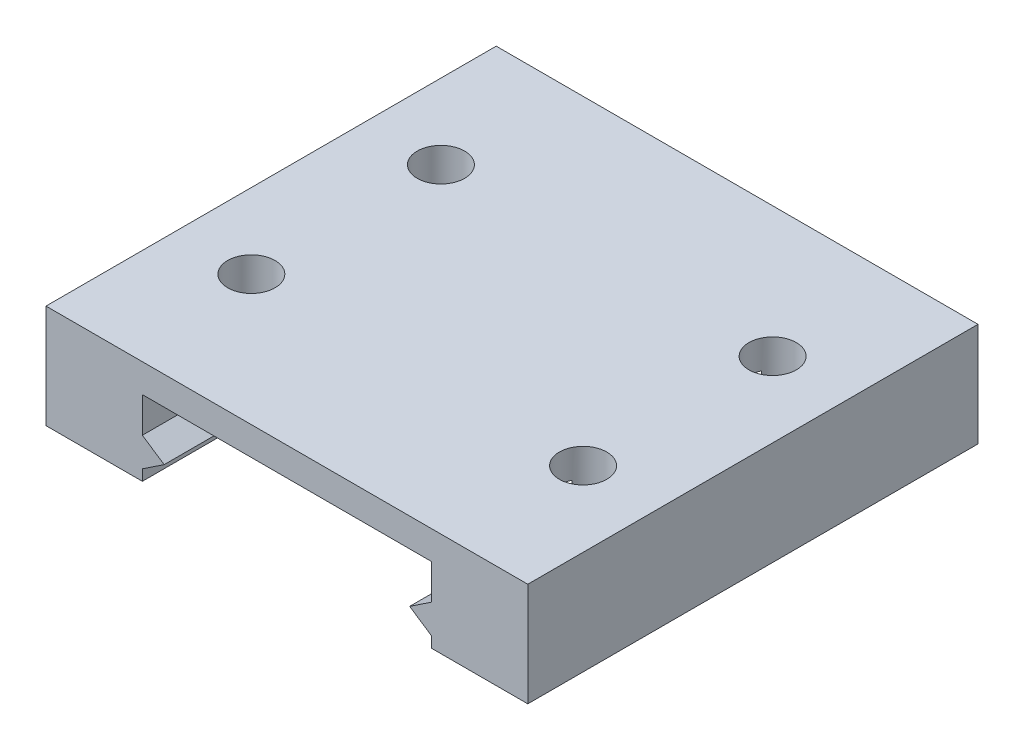
ISO-10303-21;
HEADER;
FILE_DESCRIPTION(('STEP AP214'),'2;1');
FILE_NAME('part.step','',(''),(''),'','','');
FILE_SCHEMA(('AUTOMOTIVE_DESIGN { 1 0 10303 214 1 1 1 1 }'));
ENDSEC;
DATA;
#1=APPLICATION_CONTEXT('core data for automotive mechanical design processes');
#2=APPLICATION_PROTOCOL_DEFINITION('international standard','automotive_design',2000,#1);
#3=PRODUCT_CONTEXT('',#1,'mechanical');
#4=PRODUCT('Part','Part','',(#3));
#5=PRODUCT_RELATED_PRODUCT_CATEGORY('part','',(#4));
#6=PRODUCT_DEFINITION_FORMATION('','',#4);
#7=PRODUCT_DEFINITION_CONTEXT('part definition',#1,'design');
#8=PRODUCT_DEFINITION('design','',#6,#7);
#9=PRODUCT_DEFINITION_SHAPE('','',#8);
#10=(LENGTH_UNIT() NAMED_UNIT(*) SI_UNIT(.MILLI.,.METRE.));
#11=(NAMED_UNIT(*) PLANE_ANGLE_UNIT() SI_UNIT($,.RADIAN.));
#12=(NAMED_UNIT(*) SI_UNIT($,.STERADIAN.) SOLID_ANGLE_UNIT());
#13=UNCERTAINTY_MEASURE_WITH_UNIT(LENGTH_MEASURE(1.E-05),#10,'distance_accuracy_value','');
#14=(GEOMETRIC_REPRESENTATION_CONTEXT(3) GLOBAL_UNCERTAINTY_ASSIGNED_CONTEXT((#13)) GLOBAL_UNIT_ASSIGNED_CONTEXT((#10,
#11,#12)) REPRESENTATION_CONTEXT('',''));
#15=CARTESIAN_POINT('',(0.,0.,0.));
#16=DIRECTION('',(0.,0.,1.));
#17=DIRECTION('',(1.,0.,0.));
#18=AXIS2_PLACEMENT_3D('',#15,#16,#17);
#19=CARTESIAN_POINT('',(-15.25,-1.10557624605078,-28.5));
#20=DIRECTION('',(0.,-1.,0.));
#21=DIRECTION('',(0.,0.,-1.));
#22=AXIS2_PLACEMENT_3D('',#19,#20,#21);
#23=PLANE('',#22);
#24=DIRECTION('',(1.,0.,0.));
#25=VECTOR('',#24,1.);
#26=CARTESIAN_POINT('',(-15.25,-1.10557624605078,0.));
#27=LINE('',#26,#25);
#28=CARTESIAN_POINT('',(-15.25,-1.10557624605078,0.));
#29=VERTEX_POINT('',#28);
#30=CARTESIAN_POINT('',(-9.15,-1.10557624605078,0.));
#31=VERTEX_POINT('',#30);
#32=EDGE_CURVE('E261',#29,#31,#27,.T.);
#33=ORIENTED_EDGE('',*,*,#32,.F.);
#34=DIRECTION('',(0.,0.,1.));
#35=VECTOR('',#34,1.);
#36=CARTESIAN_POINT('',(-15.25,-1.10557624605078,-28.5));
#37=LINE('',#36,#35);
#38=CARTESIAN_POINT('',(-15.25,-1.10557624605078,-28.5));
#39=VERTEX_POINT('',#38);
#40=EDGE_CURVE('E192',#39,#29,#37,.T.);
#41=ORIENTED_EDGE('',*,*,#40,.F.);
#42=DIRECTION('',(1.,0.,0.));
#43=VECTOR('',#42,1.);
#44=CARTESIAN_POINT('',(-15.25,-1.10557624605078,-28.5));
#45=LINE('',#44,#43);
#46=CARTESIAN_POINT('',(-9.15,-1.10557624605078,-28.5));
#47=VERTEX_POINT('',#46);
#48=EDGE_CURVE('E262',#39,#47,#45,.T.);
#49=ORIENTED_EDGE('',*,*,#48,.T.);
#50=DIRECTION('',(0.,0.,1.));
#51=VECTOR('',#50,1.);
#52=CARTESIAN_POINT('',(-9.15,-1.10557624605078,-28.5));
#53=LINE('',#52,#51);
#54=EDGE_CURVE('E305',#47,#31,#53,.T.);
#55=ORIENTED_EDGE('',*,*,#54,.T.);
#56=EDGE_LOOP('',(#33,#41,#49,#55));
#57=FACE_BOUND('',#56,.T.);
#58=ADVANCED_FACE('F34',(#57),#23,.T.);
#59=CARTESIAN_POINT('',(-15.25,5.45289455990468,-28.5));
#60=DIRECTION('',(-1.,0.,0.));
#61=DIRECTION('',(0.,0.,1.));
#62=AXIS2_PLACEMENT_3D('',#59,#60,#61);
#63=PLANE('',#62);
#64=DIRECTION('',(0.,-1.,0.));
#65=VECTOR('',#64,1.);
#66=CARTESIAN_POINT('',(-15.25,5.45289455990468,0.));
#67=LINE('',#66,#65);
#68=CARTESIAN_POINT('',(-15.25,5.45289455990468,0.));
#69=VERTEX_POINT('',#68);
#70=EDGE_CURVE('E266',#69,#29,#67,.T.);
#71=ORIENTED_EDGE('',*,*,#70,.F.);
#72=DIRECTION('',(0.,0.,1.));
#73=VECTOR('',#72,1.);
#74=CARTESIAN_POINT('',(-15.25,5.45289455990468,-28.5));
#75=LINE('',#74,#73);
#76=CARTESIAN_POINT('',(-15.25,5.45289455990468,-28.5));
#77=VERTEX_POINT('',#76);
#78=EDGE_CURVE('E347',#77,#69,#75,.T.);
#79=ORIENTED_EDGE('',*,*,#78,.F.);
#80=DIRECTION('',(0.,-1.,0.));
#81=VECTOR('',#80,1.);
#82=CARTESIAN_POINT('',(-15.25,5.45289455990468,-28.5));
#83=LINE('',#82,#81);
#84=EDGE_CURVE('E302',#77,#39,#83,.T.);
#85=ORIENTED_EDGE('',*,*,#84,.T.);
#86=ORIENTED_EDGE('',*,*,#40,.T.);
#87=EDGE_LOOP('',(#71,#79,#85,#86));
#88=FACE_BOUND('',#87,.T.);
#89=ADVANCED_FACE('F388',(#88),#63,.T.);
#90=CARTESIAN_POINT('',(-15.25,5.45289455990468,-28.5));
#91=DIRECTION('',(0.,1.,0.));
#92=DIRECTION('',(-1.,0.,0.));
#93=AXIS2_PLACEMENT_3D('',#90,#91,#92);
#94=PLANE('',#93);
#95=CARTESIAN_POINT('',(10.5,5.45289455990468,-8.25));
#96=DIRECTION('',(0.,1.,0.));
#97=DIRECTION('',(-1.,0.,0.));
#98=AXIS2_PLACEMENT_3D('',#95,#96,#97);
#99=CIRCLE('',#98,1.5);
#100=CARTESIAN_POINT('',(9.,5.45289455990468,-8.25));
#101=VERTEX_POINT('',#100);
#102=EDGE_CURVE('E248',#101,#101,#99,.T.);
#103=ORIENTED_EDGE('',*,*,#102,.F.);
#104=EDGE_LOOP('',(#103));
#105=FACE_BOUND('',#104,.T.);
#106=CARTESIAN_POINT('',(10.5,5.45289455990468,-20.25));
#107=DIRECTION('',(0.,1.,0.));
#108=DIRECTION('',(-1.,0.,0.));
#109=AXIS2_PLACEMENT_3D('',#106,#107,#108);
#110=CIRCLE('',#109,1.5);
#111=CARTESIAN_POINT('',(9.,5.45289455990468,-20.25));
#112=VERTEX_POINT('',#111);
#113=EDGE_CURVE('E236',#112,#112,#110,.T.);
#114=ORIENTED_EDGE('',*,*,#113,.F.);
#115=EDGE_LOOP('',(#114));
#116=FACE_BOUND('',#115,.T.);
#117=CARTESIAN_POINT('',(-10.5,5.45289455990468,-20.25));
#118=DIRECTION('',(0.,1.,0.));
#119=DIRECTION('',(-1.,0.,0.));
#120=AXIS2_PLACEMENT_3D('',#117,#118,#119);
#121=CIRCLE('',#120,1.5);
#122=CARTESIAN_POINT('',(-12.,5.45289455990468,-20.25));
#123=VERTEX_POINT('',#122);
#124=EDGE_CURVE('E235',#123,#123,#121,.T.);
#125=ORIENTED_EDGE('',*,*,#124,.F.);
#126=EDGE_LOOP('',(#125));
#127=FACE_BOUND('',#126,.T.);
#128=CARTESIAN_POINT('',(-10.5,5.45289455990468,-8.25));
#129=DIRECTION('',(0.,1.,0.));
#130=DIRECTION('',(-1.,0.,0.));
#131=AXIS2_PLACEMENT_3D('',#128,#129,#130);
#132=CIRCLE('',#131,1.5);
#133=CARTESIAN_POINT('',(-12.,5.45289455990468,-8.25));
#134=VERTEX_POINT('',#133);
#135=EDGE_CURVE('E200',#134,#134,#132,.T.);
#136=ORIENTED_EDGE('',*,*,#135,.F.);
#137=EDGE_LOOP('',(#136));
#138=FACE_BOUND('',#137,.T.);
#139=DIRECTION('',(-1.,0.,0.));
#140=VECTOR('',#139,1.);
#141=CARTESIAN_POINT('',(-15.25,5.45289455990468,0.));
#142=LINE('',#141,#140);
#143=CARTESIAN_POINT('',(15.25,5.45289455990468,0.));
#144=VERTEX_POINT('',#143);
#145=EDGE_CURVE('E341',#144,#69,#142,.T.);
#146=ORIENTED_EDGE('',*,*,#145,.F.);
#147=DIRECTION('',(0.,0.,1.));
#148=VECTOR('',#147,1.);
#149=CARTESIAN_POINT('',(15.25,5.45289455990468,-28.5));
#150=LINE('',#149,#148);
#151=CARTESIAN_POINT('',(15.25,5.45289455990468,-28.5));
#152=VERTEX_POINT('',#151);
#153=EDGE_CURVE('E349',#152,#144,#150,.T.);
#154=ORIENTED_EDGE('',*,*,#153,.F.);
#155=DIRECTION('',(-1.,0.,0.));
#156=VECTOR('',#155,1.);
#157=CARTESIAN_POINT('',(-15.25,5.45289455990468,-28.5));
#158=LINE('',#157,#156);
#159=EDGE_CURVE('E299',#152,#77,#158,.T.);
#160=ORIENTED_EDGE('',*,*,#159,.T.);
#161=ORIENTED_EDGE('',*,*,#78,.T.);
#162=EDGE_LOOP('',(#146,#154,#160,#161));
#163=FACE_BOUND('',#162,.T.);
#164=ADVANCED_FACE('F430',(#105,#116,#127,#138,#163),#94,.T.);
#165=CARTESIAN_POINT('',(15.25,-1.10557624605078,-28.5));
#166=DIRECTION('',(1.,0.,0.));
#167=DIRECTION('',(0.,0.,-1.));
#168=AXIS2_PLACEMENT_3D('',#165,#166,#167);
#169=PLANE('',#168);
#170=DIRECTION('',(0.,1.,0.));
#171=VECTOR('',#170,1.);
#172=CARTESIAN_POINT('',(15.25,-1.10557624605078,0.));
#173=LINE('',#172,#171);
#174=CARTESIAN_POINT('',(15.25,-1.10557624605078,0.));
#175=VERTEX_POINT('',#174);
#176=EDGE_CURVE('E338',#175,#144,#173,.T.);
#177=ORIENTED_EDGE('',*,*,#176,.F.);
#178=DIRECTION('',(0.,0.,1.));
#179=VECTOR('',#178,1.);
#180=CARTESIAN_POINT('',(15.25,-1.10557624605078,-28.5));
#181=LINE('',#180,#179);
#182=CARTESIAN_POINT('',(15.25,-1.10557624605078,-28.5));
#183=VERTEX_POINT('',#182);
#184=EDGE_CURVE('E351',#183,#175,#181,.T.);
#185=ORIENTED_EDGE('',*,*,#184,.F.);
#186=DIRECTION('',(0.,1.,0.));
#187=VECTOR('',#186,1.);
#188=CARTESIAN_POINT('',(15.25,-1.10557624605078,-28.5));
#189=LINE('',#188,#187);
#190=EDGE_CURVE('E296',#183,#152,#189,.T.);
#191=ORIENTED_EDGE('',*,*,#190,.T.);
#192=ORIENTED_EDGE('',*,*,#153,.T.);
#193=EDGE_LOOP('',(#177,#185,#191,#192));
#194=FACE_BOUND('',#193,.T.);
#195=ADVANCED_FACE('F428',(#194),#169,.T.);
#196=CARTESIAN_POINT('',(9.15,-1.10557624605078,-28.5));
#197=DIRECTION('',(0.,-1.,0.));
#198=DIRECTION('',(0.,0.,-1.));
#199=AXIS2_PLACEMENT_3D('',#196,#197,#198);
#200=PLANE('',#199);
#201=DIRECTION('',(1.,0.,0.));
#202=VECTOR('',#201,1.);
#203=CARTESIAN_POINT('',(9.15,-1.10557624605078,0.));
#204=LINE('',#203,#202);
#205=CARTESIAN_POINT('',(9.15,-1.10557624605078,0.));
#206=VERTEX_POINT('',#205);
#207=EDGE_CURVE('E335',#206,#175,#204,.T.);
#208=ORIENTED_EDGE('',*,*,#207,.F.);
#209=DIRECTION('',(0.,0.,1.));
#210=VECTOR('',#209,1.);
#211=CARTESIAN_POINT('',(9.15,-1.10557624605078,-28.5));
#212=LINE('',#211,#210);
#213=CARTESIAN_POINT('',(9.15,-1.10557624605078,-28.5));
#214=VERTEX_POINT('',#213);
#215=EDGE_CURVE('E353',#214,#206,#212,.T.);
#216=ORIENTED_EDGE('',*,*,#215,.F.);
#217=DIRECTION('',(1.,0.,0.));
#218=VECTOR('',#217,1.);
#219=CARTESIAN_POINT('',(9.15,-1.10557624605078,-28.5));
#220=LINE('',#219,#218);
#221=EDGE_CURVE('E293',#214,#183,#220,.T.);
#222=ORIENTED_EDGE('',*,*,#221,.T.);
#223=ORIENTED_EDGE('',*,*,#184,.T.);
#224=EDGE_LOOP('',(#208,#216,#222,#223));
#225=FACE_BOUND('',#224,.T.);
#226=ADVANCED_FACE('F424',(#225),#200,.T.);
#227=CARTESIAN_POINT('',(9.15,-0.4197224362268,-28.5));
#228=DIRECTION('',(-1.,0.,0.));
#229=DIRECTION('',(0.,0.,1.));
#230=AXIS2_PLACEMENT_3D('',#227,#228,#229);
#231=PLANE('',#230);
#232=DIRECTION('',(0.,-1.,0.));
#233=VECTOR('',#232,1.);
#234=CARTESIAN_POINT('',(9.15,-0.4197224362268,0.));
#235=LINE('',#234,#233);
#236=CARTESIAN_POINT('',(9.15,-0.4197224362268,0.));
#237=VERTEX_POINT('',#236);
#238=EDGE_CURVE('E332',#237,#206,#235,.T.);
#239=ORIENTED_EDGE('',*,*,#238,.F.);
#240=DIRECTION('',(0.,0.,1.));
#241=VECTOR('',#240,1.);
#242=CARTESIAN_POINT('',(9.15,-0.4197224362268,-28.5));
#243=LINE('',#242,#241);
#244=CARTESIAN_POINT('',(9.15,-0.4197224362268,-28.5));
#245=VERTEX_POINT('',#244);
#246=EDGE_CURVE('E355',#245,#237,#243,.T.);
#247=ORIENTED_EDGE('',*,*,#246,.F.);
#248=DIRECTION('',(0.,-1.,0.));
#249=VECTOR('',#248,1.);
#250=CARTESIAN_POINT('',(9.15,-0.4197224362268,-28.5));
#251=LINE('',#250,#249);
#252=EDGE_CURVE('E290',#245,#214,#251,.T.);
#253=ORIENTED_EDGE('',*,*,#252,.T.);
#254=ORIENTED_EDGE('',*,*,#215,.T.);
#255=EDGE_LOOP('',(#239,#247,#253,#254));
#256=FACE_BOUND('',#255,.T.);
#257=ADVANCED_FACE('F420',(#256),#231,.T.);
#258=CARTESIAN_POINT('',(7.7704163456598,0.500000000000001,-28.5));
#259=DIRECTION('',(-0.554700196225229,-0.832050294337844,0.));
#260=DIRECTION('',(0.832050294337844,-0.554700196225229,0.));
#261=AXIS2_PLACEMENT_3D('',#258,#259,#260);
#262=PLANE('',#261);
#263=DIRECTION('',(0.832050294337844,-0.554700196225229,0.));
#264=VECTOR('',#263,1.);
#265=CARTESIAN_POINT('',(7.7704163456598,0.500000000000001,0.));
#266=LINE('',#265,#264);
#267=CARTESIAN_POINT('',(7.7704163456598,0.500000000000001,0.));
#268=VERTEX_POINT('',#267);
#269=EDGE_CURVE('E329',#268,#237,#266,.T.);
#270=ORIENTED_EDGE('',*,*,#269,.F.);
#271=DIRECTION('',(0.,0.,1.));
#272=VECTOR('',#271,1.);
#273=CARTESIAN_POINT('',(7.7704163456598,0.500000000000001,-28.5));
#274=LINE('',#273,#272);
#275=CARTESIAN_POINT('',(7.7704163456598,0.500000000000001,-28.5));
#276=VERTEX_POINT('',#275);
#277=EDGE_CURVE('E357',#276,#268,#274,.T.);
#278=ORIENTED_EDGE('',*,*,#277,.F.);
#279=DIRECTION('',(0.832050294337844,-0.554700196225229,0.));
#280=VECTOR('',#279,1.);
#281=CARTESIAN_POINT('',(7.7704163456598,0.500000000000001,-28.5));
#282=LINE('',#281,#280);
#283=EDGE_CURVE('E287',#276,#245,#282,.T.);
#284=ORIENTED_EDGE('',*,*,#283,.T.);
#285=ORIENTED_EDGE('',*,*,#246,.T.);
#286=EDGE_LOOP('',(#270,#278,#284,#285));
#287=FACE_BOUND('',#286,.T.);
#288=ADVANCED_FACE('F416',(#287),#262,.T.);
#289=CARTESIAN_POINT('',(9.15,1.4197224362268,-28.5));
#290=DIRECTION('',(-0.554700196225228,0.832050294337844,0.));
#291=DIRECTION('',(-0.832050294337844,-0.554700196225228,0.));
#292=AXIS2_PLACEMENT_3D('',#289,#290,#291);
#293=PLANE('',#292);
#294=DIRECTION('',(-0.832050294337844,-0.554700196225228,0.));
#295=VECTOR('',#294,1.);
#296=CARTESIAN_POINT('',(9.15,1.4197224362268,0.));
#297=LINE('',#296,#295);
#298=CARTESIAN_POINT('',(9.15,1.4197224362268,0.));
#299=VERTEX_POINT('',#298);
#300=EDGE_CURVE('E326',#299,#268,#297,.T.);
#301=ORIENTED_EDGE('',*,*,#300,.F.);
#302=DIRECTION('',(0.,0.,1.));
#303=VECTOR('',#302,1.);
#304=CARTESIAN_POINT('',(9.15,1.4197224362268,-28.5));
#305=LINE('',#304,#303);
#306=CARTESIAN_POINT('',(9.15,1.4197224362268,-28.5));
#307=VERTEX_POINT('',#306);
#308=EDGE_CURVE('E359',#307,#299,#305,.T.);
#309=ORIENTED_EDGE('',*,*,#308,.F.);
#310=DIRECTION('',(-0.832050294337844,-0.554700196225228,0.));
#311=VECTOR('',#310,1.);
#312=CARTESIAN_POINT('',(9.15,1.4197224362268,-28.5));
#313=LINE('',#312,#311);
#314=EDGE_CURVE('E284',#307,#276,#313,.T.);
#315=ORIENTED_EDGE('',*,*,#314,.T.);
#316=ORIENTED_EDGE('',*,*,#277,.T.);
#317=EDGE_LOOP('',(#301,#309,#315,#316));
#318=FACE_BOUND('',#317,.T.);
#319=ADVANCED_FACE('F412',(#318),#293,.T.);
#320=CARTESIAN_POINT('',(9.15,3.65,-28.5));
#321=DIRECTION('',(-1.,0.,0.));
#322=DIRECTION('',(0.,0.,1.));
#323=AXIS2_PLACEMENT_3D('',#320,#321,#322);
#324=PLANE('',#323);
#325=DIRECTION('',(0.,1.,0.));
#326=VECTOR('',#325,1.);
#327=CARTESIAN_POINT('',(9.15,2.45289455990468,-7.5961651584689));
#328=LINE('',#327,#326);
#329=CARTESIAN_POINT('',(9.15,2.45289455990468,-7.5961651584689));
#330=VERTEX_POINT('',#329);
#331=CARTESIAN_POINT('',(9.15,3.65,-7.5961651584689));
#332=VERTEX_POINT('',#331);
#333=EDGE_CURVE('E48',#330,#332,#328,.T.);
#334=ORIENTED_EDGE('',*,*,#333,.F.);
#335=DIRECTION('',(0.,0.,-1.));
#336=VECTOR('',#335,1.);
#337=CARTESIAN_POINT('',(9.15,2.45289455990468,-28.5));
#338=LINE('',#337,#336);
#339=CARTESIAN_POINT('',(9.15,2.45289455990468,-8.90383484153111));
#340=VERTEX_POINT('',#339);
#341=EDGE_CURVE('E11',#330,#340,#338,.T.);
#342=ORIENTED_EDGE('',*,*,#341,.T.);
#343=DIRECTION('',(0.,1.,0.));
#344=VECTOR('',#343,1.);
#345=CARTESIAN_POINT('',(9.15,2.45289455990468,-8.90383484153111));
#346=LINE('',#345,#344);
#347=CARTESIAN_POINT('',(9.15,3.65,-8.90383484153111));
#348=VERTEX_POINT('',#347);
#349=EDGE_CURVE('E258',#348,#340,#346,.F.);
#350=ORIENTED_EDGE('',*,*,#349,.F.);
#351=DIRECTION('',(0.,0.,1.));
#352=VECTOR('',#351,1.);
#353=CARTESIAN_POINT('',(9.15,3.65,-28.5));
#354=LINE('',#353,#352);
#355=CARTESIAN_POINT('',(9.15,3.65,-19.5961651584689));
#356=VERTEX_POINT('',#355);
#357=EDGE_CURVE('E363',#356,#348,#354,.T.);
#358=ORIENTED_EDGE('',*,*,#357,.F.);
#359=DIRECTION('',(0.,1.,0.));
#360=VECTOR('',#359,1.);
#361=CARTESIAN_POINT('',(9.15,2.45289455990468,-19.5961651584689));
#362=LINE('',#361,#360);
#363=CARTESIAN_POINT('',(9.15,2.45289455990468,-19.5961651584689));
#364=VERTEX_POINT('',#363);
#365=EDGE_CURVE('E56',#364,#356,#362,.T.);
#366=ORIENTED_EDGE('',*,*,#365,.F.);
#367=DIRECTION('',(0.,0.,-1.));
#368=VECTOR('',#367,1.);
#369=CARTESIAN_POINT('',(9.15,2.45289455990468,-28.5));
#370=LINE('',#369,#368);
#371=CARTESIAN_POINT('',(9.15,2.45289455990468,-20.9038348415311));
#372=VERTEX_POINT('',#371);
#373=EDGE_CURVE('E41',#364,#372,#370,.T.);
#374=ORIENTED_EDGE('',*,*,#373,.T.);
#375=DIRECTION('',(0.,1.,0.));
#376=VECTOR('',#375,1.);
#377=CARTESIAN_POINT('',(9.15,2.45289455990468,-20.9038348415311));
#378=LINE('',#377,#376);
#379=CARTESIAN_POINT('',(9.15,3.65,-20.9038348415311));
#380=VERTEX_POINT('',#379);
#381=EDGE_CURVE('E226',#380,#372,#378,.F.);
#382=ORIENTED_EDGE('',*,*,#381,.F.);
#383=CARTESIAN_POINT('',(9.15,3.65,-28.5));
#384=VERTEX_POINT('',#383);
#385=EDGE_CURVE('E361',#384,#380,#354,.T.);
#386=ORIENTED_EDGE('',*,*,#385,.F.);
#387=DIRECTION('',(0.,-1.,0.));
#388=VECTOR('',#387,1.);
#389=CARTESIAN_POINT('',(9.15,3.65,-28.5));
#390=LINE('',#389,#388);
#391=EDGE_CURVE('E281',#384,#307,#390,.T.);
#392=ORIENTED_EDGE('',*,*,#391,.T.);
#393=ORIENTED_EDGE('',*,*,#308,.T.);
#394=DIRECTION('',(0.,-1.,0.));
#395=VECTOR('',#394,1.);
#396=CARTESIAN_POINT('',(9.15,3.65,0.));
#397=LINE('',#396,#395);
#398=CARTESIAN_POINT('',(9.15,3.65,0.));
#399=VERTEX_POINT('',#398);
#400=EDGE_CURVE('E323',#399,#299,#397,.T.);
#401=ORIENTED_EDGE('',*,*,#400,.F.);
#402=EDGE_CURVE('E364',#332,#399,#354,.T.);
#403=ORIENTED_EDGE('',*,*,#402,.F.);
#404=EDGE_LOOP('',(#334,#342,#350,#358,#366,#374,#382,#386,#392,#393,#401,#403));
#405=FACE_BOUND('',#404,.T.);
#406=ADVANCED_FACE('F225',(#405),#324,.T.);
#407=CARTESIAN_POINT('',(-9.15,3.65,-28.5));
#408=DIRECTION('',(0.,-1.,0.));
#409=DIRECTION('',(0.,0.,-1.));
#410=AXIS2_PLACEMENT_3D('',#407,#408,#409);
#411=PLANE('',#410);
#412=CARTESIAN_POINT('',(10.5,3.65,-8.25));
#413=DIRECTION('',(0.,-1.,0.));
#414=DIRECTION('',(0.,0.,-1.));
#415=AXIS2_PLACEMENT_3D('',#412,#413,#414);
#416=CIRCLE('',#415,1.5);
#417=EDGE_CURVE('E221',#332,#348,#416,.T.);
#418=ORIENTED_EDGE('',*,*,#417,.F.);
#419=ORIENTED_EDGE('',*,*,#402,.T.);
#420=DIRECTION('',(1.,0.,0.));
#421=VECTOR('',#420,1.);
#422=CARTESIAN_POINT('',(-9.15,3.65,0.));
#423=LINE('',#422,#421);
#424=CARTESIAN_POINT('',(-9.15,3.65,0.));
#425=VERTEX_POINT('',#424);
#426=EDGE_CURVE('E320',#425,#399,#423,.T.);
#427=ORIENTED_EDGE('',*,*,#426,.F.);
#428=DIRECTION('',(0.,0.,1.));
#429=VECTOR('',#428,1.);
#430=CARTESIAN_POINT('',(-9.15,3.65,-28.5));
#431=LINE('',#430,#429);
#432=CARTESIAN_POINT('',(-9.15,3.65,-7.5961651584689));
#433=VERTEX_POINT('',#432);
#434=EDGE_CURVE('E368',#433,#425,#431,.T.);
#435=ORIENTED_EDGE('',*,*,#434,.F.);
#436=CARTESIAN_POINT('',(-10.5,3.65,-8.25));
#437=DIRECTION('',(0.,-1.,0.));
#438=DIRECTION('',(0.,0.,-1.));
#439=AXIS2_PLACEMENT_3D('',#436,#437,#438);
#440=CIRCLE('',#439,1.5);
#441=CARTESIAN_POINT('',(-9.15,3.65,-8.9038348415311));
#442=VERTEX_POINT('',#441);
#443=EDGE_CURVE('E199',#442,#433,#440,.T.);
#444=ORIENTED_EDGE('',*,*,#443,.F.);
#445=CARTESIAN_POINT('',(-9.15,3.65,-19.5961651584689));
#446=VERTEX_POINT('',#445);
#447=EDGE_CURVE('E207',#446,#442,#431,.T.);
#448=ORIENTED_EDGE('',*,*,#447,.F.);
#449=CARTESIAN_POINT('',(-10.5,3.65,-20.25));
#450=DIRECTION('',(0.,-1.,0.));
#451=DIRECTION('',(0.,0.,-1.));
#452=AXIS2_PLACEMENT_3D('',#449,#450,#451);
#453=CIRCLE('',#452,1.5);
#454=CARTESIAN_POINT('',(-9.15,3.65,-20.9038348415311));
#455=VERTEX_POINT('',#454);
#456=EDGE_CURVE('E254',#455,#446,#453,.T.);
#457=ORIENTED_EDGE('',*,*,#456,.F.);
#458=CARTESIAN_POINT('',(-9.15,3.65,-28.5));
#459=VERTEX_POINT('',#458);
#460=EDGE_CURVE('E365',#459,#455,#431,.T.);
#461=ORIENTED_EDGE('',*,*,#460,.F.);
#462=DIRECTION('',(1.,0.,0.));
#463=VECTOR('',#462,1.);
#464=CARTESIAN_POINT('',(-9.15,3.65,-28.5));
#465=LINE('',#464,#463);
#466=EDGE_CURVE('E278',#459,#384,#465,.T.);
#467=ORIENTED_EDGE('',*,*,#466,.T.);
#468=ORIENTED_EDGE('',*,*,#385,.T.);
#469=CARTESIAN_POINT('',(10.5,3.65,-20.25));
#470=DIRECTION('',(0.,-1.,0.));
#471=DIRECTION('',(0.,0.,-1.));
#472=AXIS2_PLACEMENT_3D('',#469,#470,#471);
#473=CIRCLE('',#472,1.5);
#474=EDGE_CURVE('E219',#356,#380,#473,.T.);
#475=ORIENTED_EDGE('',*,*,#474,.F.);
#476=ORIENTED_EDGE('',*,*,#357,.T.);
#477=EDGE_LOOP('',(#418,#419,#427,#435,#444,#448,#457,#461,#467,#468,#475,#476));
#478=FACE_BOUND('',#477,.T.);
#479=ADVANCED_FACE('F405',(#478),#411,.T.);
#480=CARTESIAN_POINT('',(-9.15,1.4197224362268,-28.5));
#481=DIRECTION('',(1.,0.,0.));
#482=DIRECTION('',(0.,0.,-1.));
#483=AXIS2_PLACEMENT_3D('',#480,#481,#482);
#484=PLANE('',#483);
#485=DIRECTION('',(0.,1.,0.));
#486=VECTOR('',#485,1.);
#487=CARTESIAN_POINT('',(-9.15,2.45289455990468,-20.9038348415311));
#488=LINE('',#487,#486);
#489=CARTESIAN_POINT('',(-9.15,2.45289455990468,-20.9038348415311));
#490=VERTEX_POINT('',#489);
#491=EDGE_CURVE('E217',#490,#455,#488,.T.);
#492=ORIENTED_EDGE('',*,*,#491,.F.);
#493=DIRECTION('',(0.,0.,1.));
#494=VECTOR('',#493,1.);
#495=CARTESIAN_POINT('',(-9.15,2.45289455990468,-28.5));
#496=LINE('',#495,#494);
#497=CARTESIAN_POINT('',(-9.15,2.45289455990468,-19.5961651584689));
#498=VERTEX_POINT('',#497);
#499=EDGE_CURVE('E208',#490,#498,#496,.T.);
#500=ORIENTED_EDGE('',*,*,#499,.T.);
#501=DIRECTION('',(0.,1.,0.));
#502=VECTOR('',#501,1.);
#503=CARTESIAN_POINT('',(-9.15,2.45289455990468,-19.5961651584689));
#504=LINE('',#503,#502);
#505=EDGE_CURVE('E211',#446,#498,#504,.F.);
#506=ORIENTED_EDGE('',*,*,#505,.F.);
#507=ORIENTED_EDGE('',*,*,#447,.T.);
#508=DIRECTION('',(0.,1.,0.));
#509=VECTOR('',#508,1.);
#510=CARTESIAN_POINT('',(-9.15,2.45289455990468,-8.9038348415311));
#511=LINE('',#510,#509);
#512=CARTESIAN_POINT('',(-9.15,2.45289455990468,-8.9038348415311));
#513=VERTEX_POINT('',#512);
#514=EDGE_CURVE('E197',#513,#442,#511,.T.);
#515=ORIENTED_EDGE('',*,*,#514,.F.);
#516=DIRECTION('',(0.,0.,1.));
#517=VECTOR('',#516,1.);
#518=CARTESIAN_POINT('',(-9.15,2.45289455990468,-28.5));
#519=LINE('',#518,#517);
#520=CARTESIAN_POINT('',(-9.15,2.45289455990468,-7.5961651584689));
#521=VERTEX_POINT('',#520);
#522=EDGE_CURVE('E183',#513,#521,#519,.T.);
#523=ORIENTED_EDGE('',*,*,#522,.T.);
#524=DIRECTION('',(0.,1.,0.));
#525=VECTOR('',#524,1.);
#526=CARTESIAN_POINT('',(-9.15,2.45289455990468,-7.5961651584689));
#527=LINE('',#526,#525);
#528=EDGE_CURVE('E191',#433,#521,#527,.F.);
#529=ORIENTED_EDGE('',*,*,#528,.F.);
#530=ORIENTED_EDGE('',*,*,#434,.T.);
#531=DIRECTION('',(0.,1.,0.));
#532=VECTOR('',#531,1.);
#533=CARTESIAN_POINT('',(-9.15,1.4197224362268,0.));
#534=LINE('',#533,#532);
#535=CARTESIAN_POINT('',(-9.15,1.4197224362268,0.));
#536=VERTEX_POINT('',#535);
#537=EDGE_CURVE('E317',#536,#425,#534,.T.);
#538=ORIENTED_EDGE('',*,*,#537,.F.);
#539=DIRECTION('',(0.,0.,1.));
#540=VECTOR('',#539,1.);
#541=CARTESIAN_POINT('',(-9.15,1.4197224362268,-28.5));
#542=LINE('',#541,#540);
#543=CARTESIAN_POINT('',(-9.15,1.4197224362268,-28.5));
#544=VERTEX_POINT('',#543);
#545=EDGE_CURVE('E369',#544,#536,#542,.T.);
#546=ORIENTED_EDGE('',*,*,#545,.F.);
#547=DIRECTION('',(0.,1.,0.));
#548=VECTOR('',#547,1.);
#549=CARTESIAN_POINT('',(-9.15,1.4197224362268,-28.5));
#550=LINE('',#549,#548);
#551=EDGE_CURVE('E275',#544,#459,#550,.T.);
#552=ORIENTED_EDGE('',*,*,#551,.T.);
#553=ORIENTED_EDGE('',*,*,#460,.T.);
#554=EDGE_LOOP('',(#492,#500,#506,#507,#515,#523,#529,#530,#538,#546,#552,#553));
#555=FACE_BOUND('',#554,.T.);
#556=ADVANCED_FACE('F204',(#555),#484,.T.);
#557=CARTESIAN_POINT('',(-7.7704163456598,0.500000000000001,-28.5));
#558=DIRECTION('',(0.554700196225229,0.832050294337844,0.));
#559=DIRECTION('',(-0.832050294337844,0.554700196225229,0.));
#560=AXIS2_PLACEMENT_3D('',#557,#558,#559);
#561=PLANE('',#560);
#562=DIRECTION('',(-0.832050294337844,0.554700196225229,0.));
#563=VECTOR('',#562,1.);
#564=CARTESIAN_POINT('',(-7.7704163456598,0.500000000000001,0.));
#565=LINE('',#564,#563);
#566=CARTESIAN_POINT('',(-7.7704163456598,0.500000000000001,0.));
#567=VERTEX_POINT('',#566);
#568=EDGE_CURVE('E314',#567,#536,#565,.T.);
#569=ORIENTED_EDGE('',*,*,#568,.F.);
#570=DIRECTION('',(0.,0.,1.));
#571=VECTOR('',#570,1.);
#572=CARTESIAN_POINT('',(-7.7704163456598,0.500000000000001,-28.5));
#573=LINE('',#572,#571);
#574=CARTESIAN_POINT('',(-7.7704163456598,0.500000000000001,-28.5));
#575=VERTEX_POINT('',#574);
#576=EDGE_CURVE('E371',#575,#567,#573,.T.);
#577=ORIENTED_EDGE('',*,*,#576,.F.);
#578=DIRECTION('',(-0.832050294337844,0.554700196225229,0.));
#579=VECTOR('',#578,1.);
#580=CARTESIAN_POINT('',(-7.7704163456598,0.500000000000001,-28.5));
#581=LINE('',#580,#579);
#582=EDGE_CURVE('E272',#575,#544,#581,.T.);
#583=ORIENTED_EDGE('',*,*,#582,.T.);
#584=ORIENTED_EDGE('',*,*,#545,.T.);
#585=EDGE_LOOP('',(#569,#577,#583,#584));
#586=FACE_BOUND('',#585,.T.);
#587=ADVANCED_FACE('F401',(#586),#561,.T.);
#588=CARTESIAN_POINT('',(-9.15,-0.419722436226799,-28.5));
#589=DIRECTION('',(0.554700196225229,-0.832050294337844,0.));
#590=DIRECTION('',(0.832050294337844,0.554700196225229,0.));
#591=AXIS2_PLACEMENT_3D('',#588,#589,#590);
#592=PLANE('',#591);
#593=DIRECTION('',(0.832050294337844,0.554700196225229,0.));
#594=VECTOR('',#593,1.);
#595=CARTESIAN_POINT('',(-9.15,-0.419722436226799,0.));
#596=LINE('',#595,#594);
#597=CARTESIAN_POINT('',(-9.15,-0.419722436226799,0.));
#598=VERTEX_POINT('',#597);
#599=EDGE_CURVE('E311',#598,#567,#596,.T.);
#600=ORIENTED_EDGE('',*,*,#599,.F.);
#601=DIRECTION('',(0.,0.,1.));
#602=VECTOR('',#601,1.);
#603=CARTESIAN_POINT('',(-9.15,-0.419722436226799,-28.5));
#604=LINE('',#603,#602);
#605=CARTESIAN_POINT('',(-9.15,-0.419722436226799,-28.5));
#606=VERTEX_POINT('',#605);
#607=EDGE_CURVE('E373',#606,#598,#604,.T.);
#608=ORIENTED_EDGE('',*,*,#607,.F.);
#609=DIRECTION('',(0.832050294337844,0.554700196225229,0.));
#610=VECTOR('',#609,1.);
#611=CARTESIAN_POINT('',(-9.15,-0.419722436226799,-28.5));
#612=LINE('',#611,#610);
#613=EDGE_CURVE('E269',#606,#575,#612,.T.);
#614=ORIENTED_EDGE('',*,*,#613,.T.);
#615=ORIENTED_EDGE('',*,*,#576,.T.);
#616=EDGE_LOOP('',(#600,#608,#614,#615));
#617=FACE_BOUND('',#616,.T.);
#618=ADVANCED_FACE('F397',(#617),#592,.T.);
#619=CARTESIAN_POINT('',(-9.15,-1.10557624605078,-28.5));
#620=DIRECTION('',(1.,0.,0.));
#621=DIRECTION('',(0.,0.,-1.));
#622=AXIS2_PLACEMENT_3D('',#619,#620,#621);
#623=PLANE('',#622);
#624=DIRECTION('',(0.,1.,0.));
#625=VECTOR('',#624,1.);
#626=CARTESIAN_POINT('',(-9.15,-1.10557624605078,0.));
#627=LINE('',#626,#625);
#628=EDGE_CURVE('E308',#31,#598,#627,.T.);
#629=ORIENTED_EDGE('',*,*,#628,.F.);
#630=ORIENTED_EDGE('',*,*,#54,.F.);
#631=DIRECTION('',(0.,1.,0.));
#632=VECTOR('',#631,1.);
#633=CARTESIAN_POINT('',(-9.15,-1.10557624605078,-28.5));
#634=LINE('',#633,#632);
#635=EDGE_CURVE('E265',#47,#606,#634,.T.);
#636=ORIENTED_EDGE('',*,*,#635,.T.);
#637=ORIENTED_EDGE('',*,*,#607,.T.);
#638=EDGE_LOOP('',(#629,#630,#636,#637));
#639=FACE_BOUND('',#638,.T.);
#640=ADVANCED_FACE('F381',(#639),#623,.T.);
#641=CARTESIAN_POINT('',(0.,0.,-28.5));
#642=DIRECTION('',(0.,0.,1.));
#643=DIRECTION('',(1.,0.,0.));
#644=AXIS2_PLACEMENT_3D('',#641,#642,#643);
#645=PLANE('',#644);
#646=ORIENTED_EDGE('',*,*,#48,.F.);
#647=ORIENTED_EDGE('',*,*,#84,.F.);
#648=ORIENTED_EDGE('',*,*,#159,.F.);
#649=ORIENTED_EDGE('',*,*,#190,.F.);
#650=ORIENTED_EDGE('',*,*,#221,.F.);
#651=ORIENTED_EDGE('',*,*,#252,.F.);
#652=ORIENTED_EDGE('',*,*,#283,.F.);
#653=ORIENTED_EDGE('',*,*,#314,.F.);
#654=ORIENTED_EDGE('',*,*,#391,.F.);
#655=ORIENTED_EDGE('',*,*,#466,.F.);
#656=ORIENTED_EDGE('',*,*,#551,.F.);
#657=ORIENTED_EDGE('',*,*,#582,.F.);
#658=ORIENTED_EDGE('',*,*,#613,.F.);
#659=ORIENTED_EDGE('',*,*,#635,.F.);
#660=EDGE_LOOP('',(#646,#647,#648,#649,#650,#651,#652,#653,#654,#655,#656,#657,#658,#659));
#661=FACE_BOUND('',#660,.T.);
#662=ADVANCED_FACE('F391',(#661),#645,.F.);
#663=CARTESIAN_POINT('',(0.,0.,0.));
#664=DIRECTION('',(0.,0.,1.));
#665=DIRECTION('',(1.,0.,0.));
#666=AXIS2_PLACEMENT_3D('',#663,#664,#665);
#667=PLANE('',#666);
#668=ORIENTED_EDGE('',*,*,#32,.T.);
#669=ORIENTED_EDGE('',*,*,#628,.T.);
#670=ORIENTED_EDGE('',*,*,#599,.T.);
#671=ORIENTED_EDGE('',*,*,#568,.T.);
#672=ORIENTED_EDGE('',*,*,#537,.T.);
#673=ORIENTED_EDGE('',*,*,#426,.T.);
#674=ORIENTED_EDGE('',*,*,#400,.T.);
#675=ORIENTED_EDGE('',*,*,#300,.T.);
#676=ORIENTED_EDGE('',*,*,#269,.T.);
#677=ORIENTED_EDGE('',*,*,#238,.T.);
#678=ORIENTED_EDGE('',*,*,#207,.T.);
#679=ORIENTED_EDGE('',*,*,#176,.T.);
#680=ORIENTED_EDGE('',*,*,#145,.T.);
#681=ORIENTED_EDGE('',*,*,#70,.T.);
#682=EDGE_LOOP('',(#668,#669,#670,#671,#672,#673,#674,#675,#676,#677,#678,#679,#680,#681));
#683=FACE_BOUND('',#682,.T.);
#684=ADVANCED_FACE('F384',(#683),#667,.T.);
#685=CARTESIAN_POINT('',(-10.5,2.45289455990468,-8.25));
#686=DIRECTION('',(0.,1.,0.));
#687=DIRECTION('',(-1.,0.,0.));
#688=AXIS2_PLACEMENT_3D('',#685,#686,#687);
#689=CYLINDRICAL_SURFACE('',#688,1.5);
#690=ORIENTED_EDGE('',*,*,#514,.T.);
#691=ORIENTED_EDGE('',*,*,#443,.T.);
#692=ORIENTED_EDGE('',*,*,#528,.T.);
#693=CARTESIAN_POINT('',(-10.5,2.45289455990468,-8.25));
#694=DIRECTION('',(0.,1.,0.));
#695=DIRECTION('',(-1.,0.,0.));
#696=AXIS2_PLACEMENT_3D('',#693,#694,#695);
#697=CIRCLE('',#696,1.5);
#698=EDGE_CURVE('E186',#513,#521,#697,.T.);
#699=ORIENTED_EDGE('',*,*,#698,.F.);
#700=EDGE_LOOP('',(#690,#691,#692,#699));
#701=FACE_BOUND('',#700,.T.);
#702=ORIENTED_EDGE('',*,*,#135,.T.);
#703=EDGE_LOOP('',(#702));
#704=FACE_BOUND('',#703,.T.);
#705=ADVANCED_FACE('F195',(#701,#704),#689,.F.);
#706=CARTESIAN_POINT('',(-10.5,2.45289455990468,-8.25));
#707=DIRECTION('',(0.,1.,0.));
#708=DIRECTION('',(-1.,0.,0.));
#709=AXIS2_PLACEMENT_3D('',#706,#707,#708);
#710=PLANE('',#709);
#711=ORIENTED_EDGE('',*,*,#698,.T.);
#712=ORIENTED_EDGE('',*,*,#522,.F.);
#713=EDGE_LOOP('',(#711,#712));
#714=FACE_BOUND('',#713,.T.);
#715=ADVANCED_FACE('F185',(#714),#710,.T.);
#716=CARTESIAN_POINT('',(-10.5,2.45289455990468,-20.25));
#717=DIRECTION('',(0.,1.,0.));
#718=DIRECTION('',(-1.,0.,0.));
#719=AXIS2_PLACEMENT_3D('',#716,#717,#718);
#720=CYLINDRICAL_SURFACE('',#719,1.5);
#721=ORIENTED_EDGE('',*,*,#491,.T.);
#722=ORIENTED_EDGE('',*,*,#456,.T.);
#723=ORIENTED_EDGE('',*,*,#505,.T.);
#724=CARTESIAN_POINT('',(-10.5,2.45289455990468,-20.25));
#725=DIRECTION('',(0.,1.,0.));
#726=DIRECTION('',(-1.,0.,0.));
#727=AXIS2_PLACEMENT_3D('',#724,#725,#726);
#728=CIRCLE('',#727,1.5);
#729=EDGE_CURVE('E239',#490,#498,#728,.T.);
#730=ORIENTED_EDGE('',*,*,#729,.F.);
#731=EDGE_LOOP('',(#721,#722,#723,#730));
#732=FACE_BOUND('',#731,.T.);
#733=ORIENTED_EDGE('',*,*,#124,.T.);
#734=EDGE_LOOP('',(#733));
#735=FACE_BOUND('',#734,.T.);
#736=ADVANCED_FACE('F435',(#732,#735),#720,.F.);
#737=CARTESIAN_POINT('',(-10.5,2.45289455990468,-20.25));
#738=DIRECTION('',(0.,1.,0.));
#739=DIRECTION('',(-1.,0.,0.));
#740=AXIS2_PLACEMENT_3D('',#737,#738,#739);
#741=PLANE('',#740);
#742=ORIENTED_EDGE('',*,*,#729,.T.);
#743=ORIENTED_EDGE('',*,*,#499,.F.);
#744=EDGE_LOOP('',(#742,#743));
#745=FACE_BOUND('',#744,.T.);
#746=ADVANCED_FACE('F438',(#745),#741,.T.);
#747=CARTESIAN_POINT('',(10.5,2.45289455990468,-20.25));
#748=DIRECTION('',(0.,1.,0.));
#749=DIRECTION('',(-1.,0.,0.));
#750=AXIS2_PLACEMENT_3D('',#747,#748,#749);
#751=CYLINDRICAL_SURFACE('',#750,1.5);
#752=ORIENTED_EDGE('',*,*,#365,.T.);
#753=ORIENTED_EDGE('',*,*,#474,.T.);
#754=ORIENTED_EDGE('',*,*,#381,.T.);
#755=CARTESIAN_POINT('',(10.5,2.45289455990468,-20.25));
#756=DIRECTION('',(0.,1.,0.));
#757=DIRECTION('',(-1.,0.,0.));
#758=AXIS2_PLACEMENT_3D('',#755,#756,#757);
#759=CIRCLE('',#758,1.5);
#760=EDGE_CURVE('E232',#364,#372,#759,.T.);
#761=ORIENTED_EDGE('',*,*,#760,.F.);
#762=EDGE_LOOP('',(#752,#753,#754,#761));
#763=FACE_BOUND('',#762,.T.);
#764=ORIENTED_EDGE('',*,*,#113,.T.);
#765=EDGE_LOOP('',(#764));
#766=FACE_BOUND('',#765,.T.);
#767=ADVANCED_FACE('F233',(#763,#766),#751,.F.);
#768=CARTESIAN_POINT('',(10.5,2.45289455990468,-20.25));
#769=DIRECTION('',(0.,1.,0.));
#770=DIRECTION('',(-1.,0.,0.));
#771=AXIS2_PLACEMENT_3D('',#768,#769,#770);
#772=PLANE('',#771);
#773=ORIENTED_EDGE('',*,*,#760,.T.);
#774=ORIENTED_EDGE('',*,*,#373,.F.);
#775=EDGE_LOOP('',(#773,#774));
#776=FACE_BOUND('',#775,.T.);
#777=ADVANCED_FACE('F231',(#776),#772,.T.);
#778=CARTESIAN_POINT('',(10.5,2.45289455990468,-8.25));
#779=DIRECTION('',(0.,1.,0.));
#780=DIRECTION('',(-1.,0.,0.));
#781=AXIS2_PLACEMENT_3D('',#778,#779,#780);
#782=CYLINDRICAL_SURFACE('',#781,1.5);
#783=ORIENTED_EDGE('',*,*,#333,.T.);
#784=ORIENTED_EDGE('',*,*,#417,.T.);
#785=ORIENTED_EDGE('',*,*,#349,.T.);
#786=CARTESIAN_POINT('',(10.5,2.45289455990468,-8.25));
#787=DIRECTION('',(0.,1.,0.));
#788=DIRECTION('',(-1.,0.,0.));
#789=AXIS2_PLACEMENT_3D('',#786,#787,#788);
#790=CIRCLE('',#789,1.5);
#791=EDGE_CURVE('E242',#330,#340,#790,.T.);
#792=ORIENTED_EDGE('',*,*,#791,.F.);
#793=EDGE_LOOP('',(#783,#784,#785,#792));
#794=FACE_BOUND('',#793,.T.);
#795=ORIENTED_EDGE('',*,*,#102,.T.);
#796=EDGE_LOOP('',(#795));
#797=FACE_BOUND('',#796,.T.);
#798=ADVANCED_FACE('F491',(#794,#797),#782,.F.);
#799=CARTESIAN_POINT('',(10.5,2.45289455990468,-8.25));
#800=DIRECTION('',(0.,1.,0.));
#801=DIRECTION('',(-1.,0.,0.));
#802=AXIS2_PLACEMENT_3D('',#799,#800,#801);
#803=PLANE('',#802);
#804=ORIENTED_EDGE('',*,*,#791,.T.);
#805=ORIENTED_EDGE('',*,*,#341,.F.);
#806=EDGE_LOOP('',(#804,#805));
#807=FACE_BOUND('',#806,.T.);
#808=ADVANCED_FACE('F494',(#807),#803,.T.);
#809=CLOSED_SHELL('',(#58,#89,#164,#195,#226,#257,#288,#319,#406,#479,#556,#587,#618,#640,#662,
#684,#705,#715,#736,#746,#767,#777,#798,#808));
#810=MANIFOLD_SOLID_BREP('B2',#809);
#811=ADVANCED_BREP_SHAPE_REPRESENTATION('',(#18,#810),#14);
#812=SHAPE_DEFINITION_REPRESENTATION(#9,#811);
ENDSEC;
END-ISO-10303-21;
